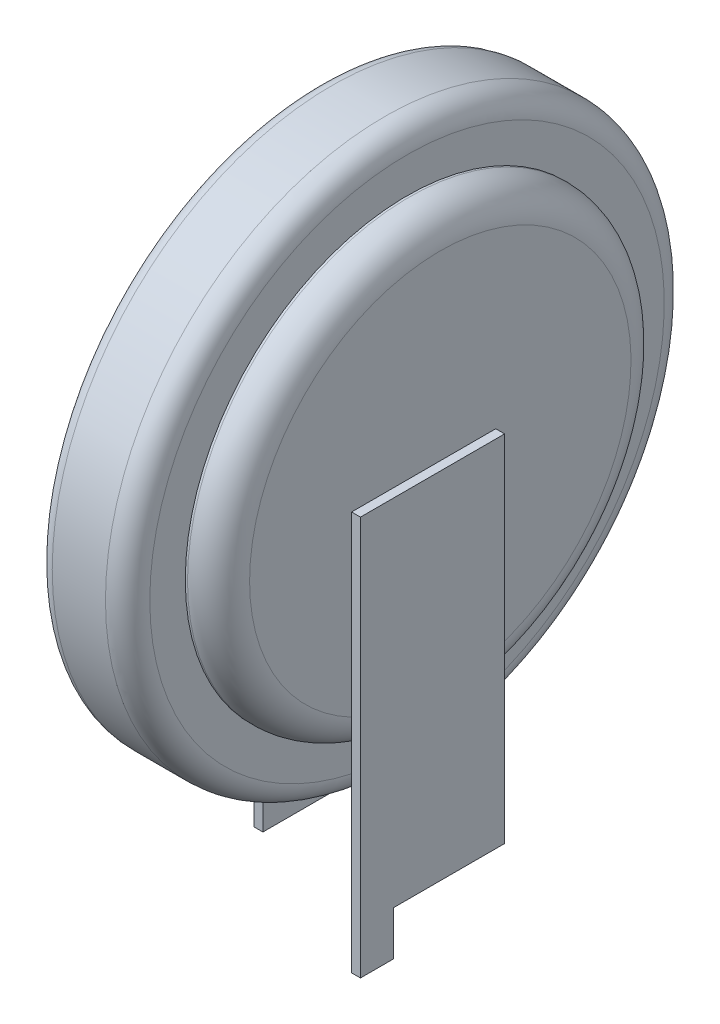
ISO-10303-21;
HEADER;
FILE_DESCRIPTION(('STEP AP214'),'2;1');
FILE_NAME('part.step','',(''),(''),'','','');
FILE_SCHEMA(('AUTOMOTIVE_DESIGN { 1 0 10303 214 1 1 1 1 }'));
ENDSEC;
DATA;
#1=APPLICATION_CONTEXT('core data for automotive mechanical design processes');
#2=APPLICATION_PROTOCOL_DEFINITION('international standard','automotive_design',2000,#1);
#3=PRODUCT_CONTEXT('',#1,'mechanical');
#4=PRODUCT('Part','Part','',(#3));
#5=PRODUCT_RELATED_PRODUCT_CATEGORY('part','',(#4));
#6=PRODUCT_DEFINITION_FORMATION('','',#4);
#7=PRODUCT_DEFINITION_CONTEXT('part definition',#1,'design');
#8=PRODUCT_DEFINITION('design','',#6,#7);
#9=PRODUCT_DEFINITION_SHAPE('','',#8);
#10=(LENGTH_UNIT() NAMED_UNIT(*) SI_UNIT(.MILLI.,.METRE.));
#11=(NAMED_UNIT(*) PLANE_ANGLE_UNIT() SI_UNIT($,.RADIAN.));
#12=(NAMED_UNIT(*) SI_UNIT($,.STERADIAN.) SOLID_ANGLE_UNIT());
#13=UNCERTAINTY_MEASURE_WITH_UNIT(LENGTH_MEASURE(1.E-05),#10,'distance_accuracy_value','');
#14=(GEOMETRIC_REPRESENTATION_CONTEXT(3) GLOBAL_UNCERTAINTY_ASSIGNED_CONTEXT((#13)) GLOBAL_UNIT_ASSIGNED_CONTEXT((#10,
#11,#12)) REPRESENTATION_CONTEXT('',''));
#15=CARTESIAN_POINT('',(0.,0.,0.));
#16=DIRECTION('',(0.,0.,1.));
#17=DIRECTION('',(1.,0.,0.));
#18=AXIS2_PLACEMENT_3D('',#15,#16,#17);
#19=CARTESIAN_POINT('',(1.375,7.8,0.));
#20=DIRECTION('',(-1.,0.,0.));
#21=DIRECTION('',(0.,0.,1.));
#22=AXIS2_PLACEMENT_3D('',#19,#20,#21);
#23=PLANE('',#22);
#24=DIRECTION('',(0.,-1.,0.));
#25=VECTOR('',#24,1.);
#26=CARTESIAN_POINT('',(1.375,8.,2.));
#27=LINE('',#26,#25);
#28=CARTESIAN_POINT('',(1.375,8.,2.));
#29=VERTEX_POINT('',#28);
#30=CARTESIAN_POINT('',(1.375,3.99342673786514,2.));
#31=VERTEX_POINT('',#30);
#32=EDGE_CURVE('E211',#29,#31,#27,.T.);
#33=ORIENTED_EDGE('',*,*,#32,.F.);
#34=DIRECTION('',(0.,0.,1.));
#35=VECTOR('',#34,1.);
#36=CARTESIAN_POINT('',(1.375,8.,-1.25));
#37=LINE('',#36,#35);
#38=CARTESIAN_POINT('',(1.375,8.,-1.25));
#39=VERTEX_POINT('',#38);
#40=EDGE_CURVE('E184',#39,#29,#37,.T.);
#41=ORIENTED_EDGE('',*,*,#40,.F.);
#42=DIRECTION('',(0.,1.,0.));
#43=VECTOR('',#42,1.);
#44=CARTESIAN_POINT('',(1.375,0.,-1.25));
#45=LINE('',#44,#43);
#46=CARTESIAN_POINT('',(1.375,3.68569568456586,-1.25));
#47=VERTEX_POINT('',#46);
#48=EDGE_CURVE('E219',#47,#39,#45,.T.);
#49=ORIENTED_EDGE('',*,*,#48,.F.);
#50=CARTESIAN_POINT('',(1.375,7.8,0.));
#51=DIRECTION('',(-1.,0.,0.));
#52=DIRECTION('',(0.,0.,1.));
#53=AXIS2_PLACEMENT_3D('',#50,#51,#52);
#54=CIRCLE('',#53,4.3);
#55=EDGE_CURVE('E41',#31,#47,#54,.T.);
#56=ORIENTED_EDGE('',*,*,#55,.F.);
#57=EDGE_LOOP('',(#33,#41,#49,#56));
#58=FACE_BOUND('',#57,.T.);
#59=ADVANCED_FACE('F33',(#58),#23,.F.);
#60=CARTESIAN_POINT('',(-1.375,13.8,0.));
#61=DIRECTION('',(1.,0.,0.));
#62=DIRECTION('',(0.,0.,-1.));
#63=AXIS2_PLACEMENT_3D('',#60,#61,#62);
#64=PLANE('',#63);
#65=DIRECTION('',(0.,0.,1.));
#66=VECTOR('',#65,1.);
#67=CARTESIAN_POINT('',(-1.375,8.,-2.));
#68=LINE('',#67,#66);
#69=CARTESIAN_POINT('',(-1.375,8.,-2.));
#70=VERTEX_POINT('',#69);
#71=CARTESIAN_POINT('',(-1.375,8.,1.25));
#72=VERTEX_POINT('',#71);
#73=EDGE_CURVE('E48',#70,#72,#68,.T.);
#74=ORIENTED_EDGE('',*,*,#73,.T.);
#75=DIRECTION('',(0.,-1.,0.));
#76=VECTOR('',#75,1.);
#77=CARTESIAN_POINT('',(-1.375,8.,1.25));
#78=LINE('',#77,#76);
#79=CARTESIAN_POINT('',(-1.375,1.93165270284725,1.25));
#80=VERTEX_POINT('',#79);
#81=EDGE_CURVE('E163',#72,#80,#78,.T.);
#82=ORIENTED_EDGE('',*,*,#81,.T.);
#83=CARTESIAN_POINT('',(-1.375,7.8,0.));
#84=DIRECTION('',(-1.,0.,0.));
#85=DIRECTION('',(0.,0.,1.));
#86=AXIS2_PLACEMENT_3D('',#83,#84,#85);
#87=CIRCLE('',#86,6.);
#88=CARTESIAN_POINT('',(-1.375,2.14314575050762,-2.));
#89=VERTEX_POINT('',#88);
#90=EDGE_CURVE('E238',#80,#89,#87,.T.);
#91=ORIENTED_EDGE('',*,*,#90,.T.);
#92=DIRECTION('',(0.,1.,0.));
#93=VECTOR('',#92,1.);
#94=CARTESIAN_POINT('',(-1.375,-1.,-2.));
#95=LINE('',#94,#93);
#96=EDGE_CURVE('E53',#89,#70,#95,.T.);
#97=ORIENTED_EDGE('',*,*,#96,.T.);
#98=EDGE_LOOP('',(#74,#82,#91,#97));
#99=FACE_BOUND('',#98,.T.);
#100=ADVANCED_FACE('F35',(#99),#64,.F.);
#101=CARTESIAN_POINT('',(0.675,7.8,0.));
#102=DIRECTION('',(-1.,0.,0.));
#103=DIRECTION('',(0.,0.,1.));
#104=AXIS2_PLACEMENT_3D('',#101,#102,#103);
#105=TOROIDAL_SURFACE('',#104,4.3,0.7);
#106=CARTESIAN_POINT('',(0.675,7.8,0.));
#107=DIRECTION('',(-1.,0.,0.));
#108=DIRECTION('',(0.,0.,1.));
#109=AXIS2_PLACEMENT_3D('',#106,#107,#108);
#110=CIRCLE('',#109,5.);
#111=CARTESIAN_POINT('',(0.675,7.8,5.));
#112=VERTEX_POINT('',#111);
#113=EDGE_CURVE('E253',#112,#112,#110,.T.);
#114=ORIENTED_EDGE('',*,*,#113,.F.);
#115=EDGE_LOOP('',(#114));
#116=FACE_BOUND('',#115,.T.);
#117=EDGE_CURVE('E11',#47,#31,#54,.T.);
#118=ORIENTED_EDGE('',*,*,#117,.T.);
#119=ORIENTED_EDGE('',*,*,#55,.T.);
#120=EDGE_LOOP('',(#118,#119));
#121=FACE_BOUND('',#120,.T.);
#122=ADVANCED_FACE('F260',(#116,#121),#105,.T.);
#123=CARTESIAN_POINT('',(-11.9332235700773,7.8,0.));
#124=DIRECTION('',(-1.,0.,0.));
#125=DIRECTION('',(0.,0.,1.));
#126=AXIS2_PLACEMENT_3D('',#123,#124,#125);
#127=CYLINDRICAL_SURFACE('',#126,5.);
#128=CARTESIAN_POINT('',(0.625000000000001,7.8,0.));
#129=DIRECTION('',(-1.,0.,0.));
#130=DIRECTION('',(0.,0.,1.));
#131=AXIS2_PLACEMENT_3D('',#128,#129,#130);
#132=CIRCLE('',#131,5.);
#133=CARTESIAN_POINT('',(0.625000000000001,7.8,5.));
#134=VERTEX_POINT('',#133);
#135=EDGE_CURVE('E251',#134,#134,#132,.T.);
#136=ORIENTED_EDGE('',*,*,#135,.F.);
#137=EDGE_LOOP('',(#136));
#138=FACE_BOUND('',#137,.T.);
#139=ORIENTED_EDGE('',*,*,#113,.T.);
#140=EDGE_LOOP('',(#139));
#141=FACE_BOUND('',#140,.T.);
#142=ADVANCED_FACE('F312',(#138,#141),#127,.T.);
#143=CARTESIAN_POINT('',(0.625,12.8,0.));
#144=DIRECTION('',(-1.,0.,0.));
#145=DIRECTION('',(0.,0.,1.));
#146=AXIS2_PLACEMENT_3D('',#143,#144,#145);
#147=PLANE('',#146);
#148=CARTESIAN_POINT('',(0.625000000000001,7.8,0.));
#149=DIRECTION('',(-1.,0.,0.));
#150=DIRECTION('',(0.,0.,1.));
#151=AXIS2_PLACEMENT_3D('',#148,#149,#150);
#152=CIRCLE('',#151,5.8);
#153=CARTESIAN_POINT('',(0.625000000000001,7.8,5.8));
#154=VERTEX_POINT('',#153);
#155=EDGE_CURVE('E248',#154,#154,#152,.T.);
#156=ORIENTED_EDGE('',*,*,#155,.F.);
#157=EDGE_LOOP('',(#156));
#158=FACE_BOUND('',#157,.T.);
#159=ORIENTED_EDGE('',*,*,#135,.T.);
#160=EDGE_LOOP('',(#159));
#161=FACE_BOUND('',#160,.T.);
#162=ADVANCED_FACE('F316',(#158,#161),#147,.F.);
#163=CARTESIAN_POINT('',(0.125,7.8,0.));
#164=DIRECTION('',(-1.,0.,0.));
#165=DIRECTION('',(0.,0.,1.));
#166=AXIS2_PLACEMENT_3D('',#163,#164,#165);
#167=TOROIDAL_SURFACE('',#166,5.8,0.499999999999999);
#168=CARTESIAN_POINT('',(0.125,7.8,0.));
#169=DIRECTION('',(-1.,0.,0.));
#170=DIRECTION('',(0.,0.,1.));
#171=AXIS2_PLACEMENT_3D('',#168,#169,#170);
#172=CIRCLE('',#171,6.3);
#173=CARTESIAN_POINT('',(0.125,7.8,6.3));
#174=VERTEX_POINT('',#173);
#175=EDGE_CURVE('E245',#174,#174,#172,.T.);
#176=ORIENTED_EDGE('',*,*,#175,.F.);
#177=EDGE_LOOP('',(#176));
#178=FACE_BOUND('',#177,.T.);
#179=ORIENTED_EDGE('',*,*,#155,.T.);
#180=EDGE_LOOP('',(#179));
#181=FACE_BOUND('',#180,.T.);
#182=ADVANCED_FACE('F320',(#178,#181),#167,.T.);
#183=CARTESIAN_POINT('',(-11.9332235700773,7.8,0.));
#184=DIRECTION('',(-1.,0.,0.));
#185=DIRECTION('',(0.,0.,1.));
#186=AXIS2_PLACEMENT_3D('',#183,#184,#185);
#187=CYLINDRICAL_SURFACE('',#186,6.3);
#188=CARTESIAN_POINT('',(-1.075,7.8,0.));
#189=DIRECTION('',(-1.,0.,0.));
#190=DIRECTION('',(0.,0.,1.));
#191=AXIS2_PLACEMENT_3D('',#188,#189,#190);
#192=CIRCLE('',#191,6.3);
#193=CARTESIAN_POINT('',(-1.075,7.8,6.3));
#194=VERTEX_POINT('',#193);
#195=EDGE_CURVE('E242',#194,#194,#192,.T.);
#196=ORIENTED_EDGE('',*,*,#195,.F.);
#197=EDGE_LOOP('',(#196));
#198=FACE_BOUND('',#197,.T.);
#199=ORIENTED_EDGE('',*,*,#175,.T.);
#200=EDGE_LOOP('',(#199));
#201=FACE_BOUND('',#200,.T.);
#202=ADVANCED_FACE('F324',(#198,#201),#187,.T.);
#203=CARTESIAN_POINT('',(-1.075,7.8,0.));
#204=DIRECTION('',(-1.,0.,0.));
#205=DIRECTION('',(0.,0.,1.));
#206=AXIS2_PLACEMENT_3D('',#203,#204,#205);
#207=TOROIDAL_SURFACE('',#206,6.,0.299999999999999);
#208=EDGE_CURVE('E239',#89,#80,#87,.T.);
#209=ORIENTED_EDGE('',*,*,#208,.F.);
#210=ORIENTED_EDGE('',*,*,#90,.F.);
#211=EDGE_LOOP('',(#209,#210));
#212=FACE_BOUND('',#211,.T.);
#213=ORIENTED_EDGE('',*,*,#195,.T.);
#214=EDGE_LOOP('',(#213));
#215=FACE_BOUND('',#214,.T.);
#216=ADVANCED_FACE('F328',(#212,#215),#207,.T.);
#217=CARTESIAN_POINT('',(1.575,8.,-1.25));
#218=DIRECTION('',(0.,-1.,0.));
#219=DIRECTION('',(0.,0.,-1.));
#220=AXIS2_PLACEMENT_3D('',#217,#218,#219);
#221=PLANE('',#220);
#222=ORIENTED_EDGE('',*,*,#40,.T.);
#223=DIRECTION('',(-1.,0.,0.));
#224=VECTOR('',#223,1.);
#225=CARTESIAN_POINT('',(1.575,8.,2.));
#226=LINE('',#225,#224);
#227=CARTESIAN_POINT('',(1.575,8.,2.));
#228=VERTEX_POINT('',#227);
#229=EDGE_CURVE('E236',#228,#29,#226,.T.);
#230=ORIENTED_EDGE('',*,*,#229,.F.);
#231=DIRECTION('',(0.,0.,1.));
#232=VECTOR('',#231,1.);
#233=CARTESIAN_POINT('',(1.575,8.,-1.25));
#234=LINE('',#233,#232);
#235=CARTESIAN_POINT('',(1.575,8.,-1.25));
#236=VERTEX_POINT('',#235);
#237=EDGE_CURVE('E193',#236,#228,#234,.T.);
#238=ORIENTED_EDGE('',*,*,#237,.F.);
#239=DIRECTION('',(-1.,0.,0.));
#240=VECTOR('',#239,1.);
#241=CARTESIAN_POINT('',(1.575,8.,-1.25));
#242=LINE('',#241,#240);
#243=EDGE_CURVE('E207',#236,#39,#242,.T.);
#244=ORIENTED_EDGE('',*,*,#243,.T.);
#245=EDGE_LOOP('',(#222,#230,#238,#244));
#246=FACE_BOUND('',#245,.T.);
#247=ADVANCED_FACE('F272',(#246),#221,.F.);
#248=CARTESIAN_POINT('',(1.575,8.,2.));
#249=DIRECTION('',(0.,0.,-1.));
#250=DIRECTION('',(0.,1.,0.));
#251=AXIS2_PLACEMENT_3D('',#248,#249,#250);
#252=PLANE('',#251);
#253=ORIENTED_EDGE('',*,*,#32,.T.);
#254=CARTESIAN_POINT('',(1.375,-1.,2.));
#255=VERTEX_POINT('',#254);
#256=EDGE_CURVE('E210',#31,#255,#27,.T.);
#257=ORIENTED_EDGE('',*,*,#256,.T.);
#258=DIRECTION('',(-1.,0.,0.));
#259=VECTOR('',#258,1.);
#260=CARTESIAN_POINT('',(1.575,-1.,2.));
#261=LINE('',#260,#259);
#262=CARTESIAN_POINT('',(1.575,-1.,2.));
#263=VERTEX_POINT('',#262);
#264=EDGE_CURVE('E233',#263,#255,#261,.T.);
#265=ORIENTED_EDGE('',*,*,#264,.F.);
#266=DIRECTION('',(0.,-1.,0.));
#267=VECTOR('',#266,1.);
#268=CARTESIAN_POINT('',(1.575,8.,2.));
#269=LINE('',#268,#267);
#270=EDGE_CURVE('E196',#228,#263,#269,.T.);
#271=ORIENTED_EDGE('',*,*,#270,.F.);
#272=ORIENTED_EDGE('',*,*,#229,.T.);
#273=EDGE_LOOP('',(#253,#257,#265,#271,#272));
#274=FACE_BOUND('',#273,.T.);
#275=ADVANCED_FACE('F287',(#274),#252,.F.);
#276=CARTESIAN_POINT('',(1.575,-1.,2.));
#277=DIRECTION('',(0.,1.,0.));
#278=DIRECTION('',(0.,0.,1.));
#279=AXIS2_PLACEMENT_3D('',#276,#277,#278);
#280=PLANE('',#279);
#281=DIRECTION('',(0.,0.,-1.));
#282=VECTOR('',#281,1.);
#283=CARTESIAN_POINT('',(1.375,-1.,2.));
#284=LINE('',#283,#282);
#285=CARTESIAN_POINT('',(1.375,-1.,1.25));
#286=VERTEX_POINT('',#285);
#287=EDGE_CURVE('E213',#255,#286,#284,.T.);
#288=ORIENTED_EDGE('',*,*,#287,.T.);
#289=DIRECTION('',(-1.,0.,0.));
#290=VECTOR('',#289,1.);
#291=CARTESIAN_POINT('',(1.575,-1.,1.25));
#292=LINE('',#291,#290);
#293=CARTESIAN_POINT('',(1.575,-1.,1.25));
#294=VERTEX_POINT('',#293);
#295=EDGE_CURVE('E230',#294,#286,#292,.T.);
#296=ORIENTED_EDGE('',*,*,#295,.F.);
#297=DIRECTION('',(0.,0.,-1.));
#298=VECTOR('',#297,1.);
#299=CARTESIAN_POINT('',(1.575,-1.,2.));
#300=LINE('',#299,#298);
#301=EDGE_CURVE('E199',#263,#294,#300,.T.);
#302=ORIENTED_EDGE('',*,*,#301,.F.);
#303=ORIENTED_EDGE('',*,*,#264,.T.);
#304=EDGE_LOOP('',(#288,#296,#302,#303));
#305=FACE_BOUND('',#304,.T.);
#306=ADVANCED_FACE('F290',(#305),#280,.F.);
#307=CARTESIAN_POINT('',(1.575,-1.,1.25));
#308=DIRECTION('',(0.,0.,1.));
#309=DIRECTION('',(1.,0.,0.));
#310=AXIS2_PLACEMENT_3D('',#307,#308,#309);
#311=PLANE('',#310);
#312=DIRECTION('',(0.,1.,0.));
#313=VECTOR('',#312,1.);
#314=CARTESIAN_POINT('',(1.375,-1.,1.25));
#315=LINE('',#314,#313);
#316=CARTESIAN_POINT('',(1.375,0.,1.25));
#317=VERTEX_POINT('',#316);
#318=EDGE_CURVE('E215',#286,#317,#315,.T.);
#319=ORIENTED_EDGE('',*,*,#318,.T.);
#320=DIRECTION('',(-1.,0.,0.));
#321=VECTOR('',#320,1.);
#322=CARTESIAN_POINT('',(1.575,0.,1.25));
#323=LINE('',#322,#321);
#324=CARTESIAN_POINT('',(1.575,0.,1.25));
#325=VERTEX_POINT('',#324);
#326=EDGE_CURVE('E227',#325,#317,#323,.T.);
#327=ORIENTED_EDGE('',*,*,#326,.F.);
#328=DIRECTION('',(0.,1.,0.));
#329=VECTOR('',#328,1.);
#330=CARTESIAN_POINT('',(1.575,-1.,1.25));
#331=LINE('',#330,#329);
#332=EDGE_CURVE('E201',#294,#325,#331,.T.);
#333=ORIENTED_EDGE('',*,*,#332,.F.);
#334=ORIENTED_EDGE('',*,*,#295,.T.);
#335=EDGE_LOOP('',(#319,#327,#333,#334));
#336=FACE_BOUND('',#335,.T.);
#337=ADVANCED_FACE('F295',(#336),#311,.F.);
#338=CARTESIAN_POINT('',(1.575,0.,1.25));
#339=DIRECTION('',(0.,1.,0.));
#340=DIRECTION('',(0.,0.,1.));
#341=AXIS2_PLACEMENT_3D('',#338,#339,#340);
#342=PLANE('',#341);
#343=DIRECTION('',(0.,0.,-1.));
#344=VECTOR('',#343,1.);
#345=CARTESIAN_POINT('',(1.375,0.,1.25));
#346=LINE('',#345,#344);
#347=CARTESIAN_POINT('',(1.375,0.,-1.25));
#348=VERTEX_POINT('',#347);
#349=EDGE_CURVE('E217',#317,#348,#346,.T.);
#350=ORIENTED_EDGE('',*,*,#349,.T.);
#351=DIRECTION('',(-1.,0.,0.));
#352=VECTOR('',#351,1.);
#353=CARTESIAN_POINT('',(1.575,0.,-1.25));
#354=LINE('',#353,#352);
#355=CARTESIAN_POINT('',(1.575,0.,-1.25));
#356=VERTEX_POINT('',#355);
#357=EDGE_CURVE('E224',#356,#348,#354,.T.);
#358=ORIENTED_EDGE('',*,*,#357,.F.);
#359=DIRECTION('',(0.,0.,-1.));
#360=VECTOR('',#359,1.);
#361=CARTESIAN_POINT('',(1.575,0.,1.25));
#362=LINE('',#361,#360);
#363=EDGE_CURVE('E203',#325,#356,#362,.T.);
#364=ORIENTED_EDGE('',*,*,#363,.F.);
#365=ORIENTED_EDGE('',*,*,#326,.T.);
#366=EDGE_LOOP('',(#350,#358,#364,#365));
#367=FACE_BOUND('',#366,.T.);
#368=ADVANCED_FACE('F296',(#367),#342,.F.);
#369=CARTESIAN_POINT('',(1.575,0.,-1.25));
#370=DIRECTION('',(0.,0.,1.));
#371=DIRECTION('',(0.,-1.,0.));
#372=AXIS2_PLACEMENT_3D('',#369,#370,#371);
#373=PLANE('',#372);
#374=EDGE_CURVE('E197',#348,#47,#45,.T.);
#375=ORIENTED_EDGE('',*,*,#374,.T.);
#376=ORIENTED_EDGE('',*,*,#48,.T.);
#377=ORIENTED_EDGE('',*,*,#243,.F.);
#378=DIRECTION('',(0.,1.,0.));
#379=VECTOR('',#378,1.);
#380=CARTESIAN_POINT('',(1.575,0.,-1.25));
#381=LINE('',#380,#379);
#382=EDGE_CURVE('E205',#356,#236,#381,.T.);
#383=ORIENTED_EDGE('',*,*,#382,.F.);
#384=ORIENTED_EDGE('',*,*,#357,.T.);
#385=EDGE_LOOP('',(#375,#376,#377,#383,#384));
#386=FACE_BOUND('',#385,.T.);
#387=ADVANCED_FACE('F267',(#386),#373,.F.);
#388=CARTESIAN_POINT('',(1.575,0.,0.));
#389=DIRECTION('',(1.,0.,0.));
#390=DIRECTION('',(0.,0.,-1.));
#391=AXIS2_PLACEMENT_3D('',#388,#389,#390);
#392=PLANE('',#391);
#393=ORIENTED_EDGE('',*,*,#237,.T.);
#394=ORIENTED_EDGE('',*,*,#270,.T.);
#395=ORIENTED_EDGE('',*,*,#301,.T.);
#396=ORIENTED_EDGE('',*,*,#332,.T.);
#397=ORIENTED_EDGE('',*,*,#363,.T.);
#398=ORIENTED_EDGE('',*,*,#382,.T.);
#399=EDGE_LOOP('',(#393,#394,#395,#396,#397,#398));
#400=FACE_BOUND('',#399,.T.);
#401=ADVANCED_FACE('F275',(#400),#392,.T.);
#402=CARTESIAN_POINT('',(1.375,0.,0.));
#403=DIRECTION('',(1.,0.,0.));
#404=DIRECTION('',(0.,0.,-1.));
#405=AXIS2_PLACEMENT_3D('',#402,#403,#404);
#406=PLANE('',#405);
#407=ORIENTED_EDGE('',*,*,#117,.F.);
#408=ORIENTED_EDGE('',*,*,#374,.F.);
#409=ORIENTED_EDGE('',*,*,#349,.F.);
#410=ORIENTED_EDGE('',*,*,#318,.F.);
#411=ORIENTED_EDGE('',*,*,#287,.F.);
#412=ORIENTED_EDGE('',*,*,#256,.F.);
#413=EDGE_LOOP('',(#407,#408,#409,#410,#411,#412));
#414=FACE_BOUND('',#413,.T.);
#415=ADVANCED_FACE('F282',(#414),#406,.F.);
#416=CARTESIAN_POINT('',(-1.575,0.,-1.25));
#417=DIRECTION('',(0.,0.,1.));
#418=DIRECTION('',(0.,-1.,0.));
#419=AXIS2_PLACEMENT_3D('',#416,#417,#418);
#420=PLANE('',#419);
#421=DIRECTION('',(0.,-1.,0.));
#422=VECTOR('',#421,1.);
#423=CARTESIAN_POINT('',(-1.375,0.,-1.25));
#424=LINE('',#423,#422);
#425=CARTESIAN_POINT('',(-1.375,0.,-1.25));
#426=VERTEX_POINT('',#425);
#427=CARTESIAN_POINT('',(-1.375,-1.,-1.25));
#428=VERTEX_POINT('',#427);
#429=EDGE_CURVE('E174',#426,#428,#424,.T.);
#430=ORIENTED_EDGE('',*,*,#429,.F.);
#431=DIRECTION('',(1.,0.,0.));
#432=VECTOR('',#431,1.);
#433=CARTESIAN_POINT('',(-1.575,0.,-1.25));
#434=LINE('',#433,#432);
#435=CARTESIAN_POINT('',(-1.575,0.,-1.25));
#436=VERTEX_POINT('',#435);
#437=EDGE_CURVE('E159',#436,#426,#434,.T.);
#438=ORIENTED_EDGE('',*,*,#437,.F.);
#439=DIRECTION('',(0.,-1.,0.));
#440=VECTOR('',#439,1.);
#441=CARTESIAN_POINT('',(-1.575,0.,-1.25));
#442=LINE('',#441,#440);
#443=CARTESIAN_POINT('',(-1.575,-1.,-1.25));
#444=VERTEX_POINT('',#443);
#445=EDGE_CURVE('E152',#436,#444,#442,.T.);
#446=ORIENTED_EDGE('',*,*,#445,.T.);
#447=DIRECTION('',(1.,0.,0.));
#448=VECTOR('',#447,1.);
#449=CARTESIAN_POINT('',(-1.575,-1.,-1.25));
#450=LINE('',#449,#448);
#451=EDGE_CURVE('E134',#444,#428,#450,.T.);
#452=ORIENTED_EDGE('',*,*,#451,.T.);
#453=EDGE_LOOP('',(#430,#438,#446,#452));
#454=FACE_BOUND('',#453,.T.);
#455=ADVANCED_FACE('F158',(#454),#420,.T.);
#456=CARTESIAN_POINT('',(-1.575,0.,1.25));
#457=DIRECTION('',(0.,-1.,0.));
#458=DIRECTION('',(0.,0.,-1.));
#459=AXIS2_PLACEMENT_3D('',#456,#457,#458);
#460=PLANE('',#459);
#461=DIRECTION('',(0.,0.,-1.));
#462=VECTOR('',#461,1.);
#463=CARTESIAN_POINT('',(-1.375,0.,1.25));
#464=LINE('',#463,#462);
#465=CARTESIAN_POINT('',(-1.375,0.,1.25));
#466=VERTEX_POINT('',#465);
#467=EDGE_CURVE('E160',#466,#426,#464,.T.);
#468=ORIENTED_EDGE('',*,*,#467,.F.);
#469=DIRECTION('',(1.,0.,0.));
#470=VECTOR('',#469,1.);
#471=CARTESIAN_POINT('',(-1.575,0.,1.25));
#472=LINE('',#471,#470);
#473=CARTESIAN_POINT('',(-1.575,0.,1.25));
#474=VERTEX_POINT('',#473);
#475=EDGE_CURVE('E185',#474,#466,#472,.T.);
#476=ORIENTED_EDGE('',*,*,#475,.F.);
#477=DIRECTION('',(0.,0.,-1.));
#478=VECTOR('',#477,1.);
#479=CARTESIAN_POINT('',(-1.575,0.,1.25));
#480=LINE('',#479,#478);
#481=EDGE_CURVE('E145',#474,#436,#480,.T.);
#482=ORIENTED_EDGE('',*,*,#481,.T.);
#483=ORIENTED_EDGE('',*,*,#437,.T.);
#484=EDGE_LOOP('',(#468,#476,#482,#483));
#485=FACE_BOUND('',#484,.T.);
#486=ADVANCED_FACE('F396',(#485),#460,.T.);
#487=CARTESIAN_POINT('',(-1.575,8.,1.25));
#488=DIRECTION('',(0.,0.,1.));
#489=DIRECTION('',(0.,-1.,0.));
#490=AXIS2_PLACEMENT_3D('',#487,#488,#489);
#491=PLANE('',#490);
#492=ORIENTED_EDGE('',*,*,#81,.F.);
#493=DIRECTION('',(1.,0.,0.));
#494=VECTOR('',#493,1.);
#495=CARTESIAN_POINT('',(-1.575,8.,1.25));
#496=LINE('',#495,#494);
#497=CARTESIAN_POINT('',(-1.575,8.,1.25));
#498=VERTEX_POINT('',#497);
#499=EDGE_CURVE('E188',#498,#72,#496,.T.);
#500=ORIENTED_EDGE('',*,*,#499,.F.);
#501=DIRECTION('',(0.,-1.,0.));
#502=VECTOR('',#501,1.);
#503=CARTESIAN_POINT('',(-1.575,8.,1.25));
#504=LINE('',#503,#502);
#505=EDGE_CURVE('E170',#498,#474,#504,.T.);
#506=ORIENTED_EDGE('',*,*,#505,.T.);
#507=ORIENTED_EDGE('',*,*,#475,.T.);
#508=EDGE_CURVE('E181',#80,#466,#78,.T.);
#509=ORIENTED_EDGE('',*,*,#508,.F.);
#510=EDGE_LOOP('',(#492,#500,#506,#507,#509));
#511=FACE_BOUND('',#510,.T.);
#512=ADVANCED_FACE('F405',(#511),#491,.T.);
#513=CARTESIAN_POINT('',(-1.575,8.,-2.));
#514=DIRECTION('',(0.,1.,0.));
#515=DIRECTION('',(0.,0.,1.));
#516=AXIS2_PLACEMENT_3D('',#513,#514,#515);
#517=PLANE('',#516);
#518=ORIENTED_EDGE('',*,*,#73,.F.);
#519=DIRECTION('',(1.,0.,0.));
#520=VECTOR('',#519,1.);
#521=CARTESIAN_POINT('',(-1.575,8.,-2.));
#522=LINE('',#521,#520);
#523=CARTESIAN_POINT('',(-1.575,8.,-2.));
#524=VERTEX_POINT('',#523);
#525=EDGE_CURVE('E190',#524,#70,#522,.T.);
#526=ORIENTED_EDGE('',*,*,#525,.F.);
#527=DIRECTION('',(0.,0.,1.));
#528=VECTOR('',#527,1.);
#529=CARTESIAN_POINT('',(-1.575,8.,-2.));
#530=LINE('',#529,#528);
#531=EDGE_CURVE('E167',#524,#498,#530,.T.);
#532=ORIENTED_EDGE('',*,*,#531,.T.);
#533=ORIENTED_EDGE('',*,*,#499,.T.);
#534=EDGE_LOOP('',(#518,#526,#532,#533));
#535=FACE_BOUND('',#534,.T.);
#536=ADVANCED_FACE('F415',(#535),#517,.T.);
#537=CARTESIAN_POINT('',(-1.575,-1.,-2.));
#538=DIRECTION('',(0.,0.,-1.));
#539=DIRECTION('',(-1.,0.,0.));
#540=AXIS2_PLACEMENT_3D('',#537,#538,#539);
#541=PLANE('',#540);
#542=CARTESIAN_POINT('',(-1.375,-1.,-2.));
#543=VERTEX_POINT('',#542);
#544=EDGE_CURVE('E177',#543,#89,#95,.T.);
#545=ORIENTED_EDGE('',*,*,#544,.F.);
#546=DIRECTION('',(1.,0.,0.));
#547=VECTOR('',#546,1.);
#548=CARTESIAN_POINT('',(-1.575,-1.,-2.));
#549=LINE('',#548,#547);
#550=CARTESIAN_POINT('',(-1.575,-1.,-2.));
#551=VERTEX_POINT('',#550);
#552=EDGE_CURVE('E144',#551,#543,#549,.T.);
#553=ORIENTED_EDGE('',*,*,#552,.F.);
#554=DIRECTION('',(0.,1.,0.));
#555=VECTOR('',#554,1.);
#556=CARTESIAN_POINT('',(-1.575,-1.,-2.));
#557=LINE('',#556,#555);
#558=EDGE_CURVE('E156',#551,#524,#557,.T.);
#559=ORIENTED_EDGE('',*,*,#558,.T.);
#560=ORIENTED_EDGE('',*,*,#525,.T.);
#561=ORIENTED_EDGE('',*,*,#96,.F.);
#562=EDGE_LOOP('',(#545,#553,#559,#560,#561));
#563=FACE_BOUND('',#562,.T.);
#564=ADVANCED_FACE('F425',(#563),#541,.T.);
#565=CARTESIAN_POINT('',(-1.575,-1.,-1.25));
#566=DIRECTION('',(0.,-1.,0.));
#567=DIRECTION('',(0.,0.,-1.));
#568=AXIS2_PLACEMENT_3D('',#565,#566,#567);
#569=PLANE('',#568);
#570=DIRECTION('',(0.,0.,-1.));
#571=VECTOR('',#570,1.);
#572=CARTESIAN_POINT('',(-1.375,-1.,-1.25));
#573=LINE('',#572,#571);
#574=EDGE_CURVE('E139',#428,#543,#573,.T.);
#575=ORIENTED_EDGE('',*,*,#574,.F.);
#576=ORIENTED_EDGE('',*,*,#451,.F.);
#577=DIRECTION('',(0.,0.,-1.));
#578=VECTOR('',#577,1.);
#579=CARTESIAN_POINT('',(-1.575,-1.,-1.25));
#580=LINE('',#579,#578);
#581=EDGE_CURVE('E137',#444,#551,#580,.T.);
#582=ORIENTED_EDGE('',*,*,#581,.T.);
#583=ORIENTED_EDGE('',*,*,#552,.T.);
#584=EDGE_LOOP('',(#575,#576,#582,#583));
#585=FACE_BOUND('',#584,.T.);
#586=ADVANCED_FACE('F136',(#585),#569,.T.);
#587=CARTESIAN_POINT('',(-1.575,0.,0.));
#588=DIRECTION('',(1.,0.,0.));
#589=DIRECTION('',(0.,0.,-1.));
#590=AXIS2_PLACEMENT_3D('',#587,#588,#589);
#591=PLANE('',#590);
#592=ORIENTED_EDGE('',*,*,#445,.F.);
#593=ORIENTED_EDGE('',*,*,#481,.F.);
#594=ORIENTED_EDGE('',*,*,#505,.F.);
#595=ORIENTED_EDGE('',*,*,#531,.F.);
#596=ORIENTED_EDGE('',*,*,#558,.F.);
#597=ORIENTED_EDGE('',*,*,#581,.F.);
#598=EDGE_LOOP('',(#592,#593,#594,#595,#596,#597));
#599=FACE_BOUND('',#598,.T.);
#600=ADVANCED_FACE('F150',(#599),#591,.F.);
#601=CARTESIAN_POINT('',(-1.375,0.,0.));
#602=DIRECTION('',(1.,0.,0.));
#603=DIRECTION('',(0.,0.,-1.));
#604=AXIS2_PLACEMENT_3D('',#601,#602,#603);
#605=PLANE('',#604);
#606=ORIENTED_EDGE('',*,*,#544,.T.);
#607=ORIENTED_EDGE('',*,*,#208,.T.);
#608=ORIENTED_EDGE('',*,*,#508,.T.);
#609=ORIENTED_EDGE('',*,*,#467,.T.);
#610=ORIENTED_EDGE('',*,*,#429,.T.);
#611=ORIENTED_EDGE('',*,*,#574,.T.);
#612=EDGE_LOOP('',(#606,#607,#608,#609,#610,#611));
#613=FACE_BOUND('',#612,.T.);
#614=ADVANCED_FACE('F452',(#613),#605,.T.);
#615=CLOSED_SHELL('',(#59,#100,#122,#142,#162,#182,#202,#216,#247,#275,#306,#337,#368,#387,#401,
#415,#455,#486,#512,#536,#564,#586,#600,#614));
#616=MANIFOLD_SOLID_BREP('B2',#615);
#617=ADVANCED_BREP_SHAPE_REPRESENTATION('',(#18,#616),#14);
#618=SHAPE_DEFINITION_REPRESENTATION(#9,#617);
ENDSEC;
END-ISO-10303-21;
